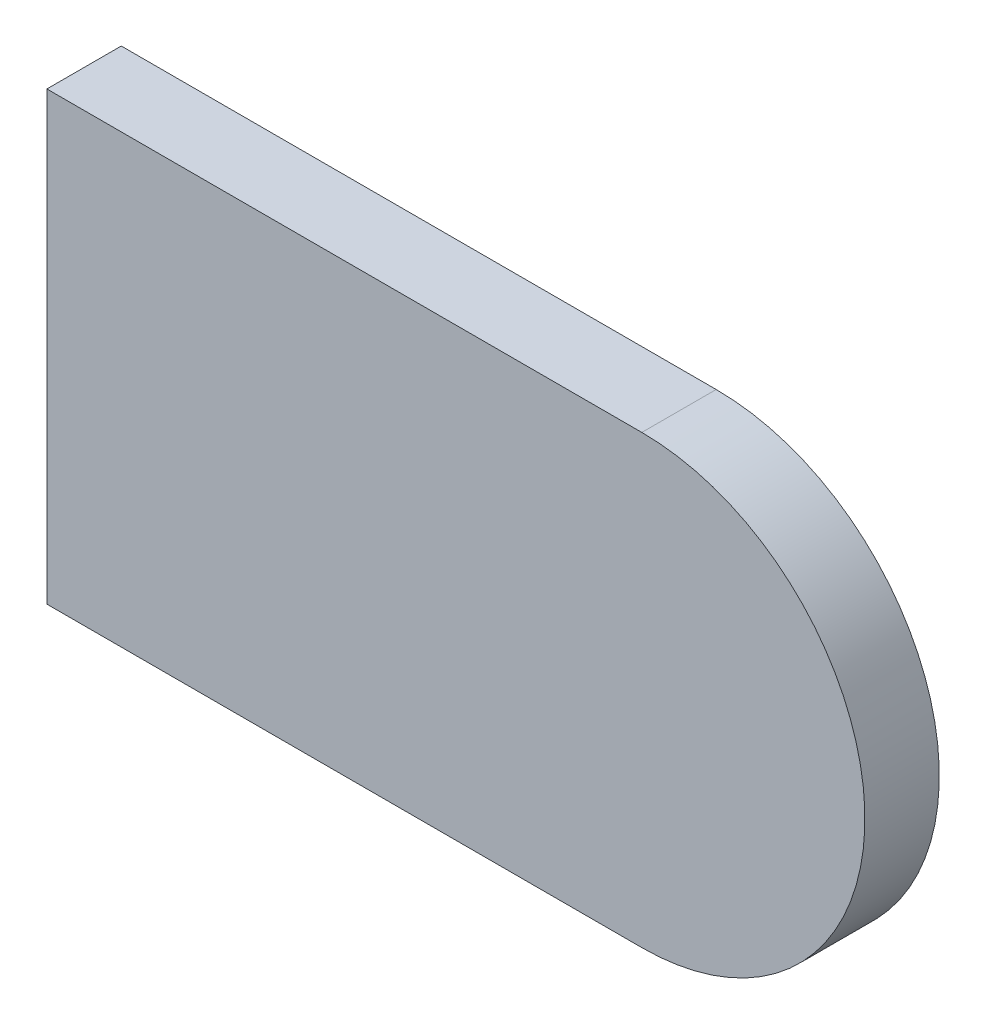
ISO-10303-21;
HEADER;
FILE_DESCRIPTION(('STEP AP214'),'2;1');
FILE_NAME('part.step','',(''),(''),'','','');
FILE_SCHEMA(('AUTOMOTIVE_DESIGN { 1 0 10303 214 1 1 1 1 }'));
ENDSEC;
DATA;
#1=APPLICATION_CONTEXT('core data for automotive mechanical design processes');
#2=APPLICATION_PROTOCOL_DEFINITION('international standard','automotive_design',2000,#1);
#3=PRODUCT_CONTEXT('',#1,'mechanical');
#4=PRODUCT('Part','Part','',(#3));
#5=PRODUCT_RELATED_PRODUCT_CATEGORY('part','',(#4));
#6=PRODUCT_DEFINITION_FORMATION('','',#4);
#7=PRODUCT_DEFINITION_CONTEXT('part definition',#1,'design');
#8=PRODUCT_DEFINITION('design','',#6,#7);
#9=PRODUCT_DEFINITION_SHAPE('','',#8);
#10=(LENGTH_UNIT() NAMED_UNIT(*) SI_UNIT(.MILLI.,.METRE.));
#11=(NAMED_UNIT(*) PLANE_ANGLE_UNIT() SI_UNIT($,.RADIAN.));
#12=(NAMED_UNIT(*) SI_UNIT($,.STERADIAN.) SOLID_ANGLE_UNIT());
#13=UNCERTAINTY_MEASURE_WITH_UNIT(LENGTH_MEASURE(1.E-05),#10,'distance_accuracy_value','');
#14=(GEOMETRIC_REPRESENTATION_CONTEXT(3) GLOBAL_UNCERTAINTY_ASSIGNED_CONTEXT((#13)) GLOBAL_UNIT_ASSIGNED_CONTEXT((#10,
#11,#12)) REPRESENTATION_CONTEXT('',''));
#15=CARTESIAN_POINT('',(0.,0.,0.));
#16=DIRECTION('',(0.,0.,1.));
#17=DIRECTION('',(1.,0.,0.));
#18=AXIS2_PLACEMENT_3D('',#15,#16,#17);
#19=CARTESIAN_POINT('',(0.,0.,10.));
#20=DIRECTION('',(1.,0.,0.));
#21=DIRECTION('',(0.,1.,0.));
#22=AXIS2_PLACEMENT_3D('',#19,#20,#21);
#23=PLANE('',#22);
#24=DIRECTION('',(0.,-1.,0.));
#25=VECTOR('',#24,1.);
#26=CARTESIAN_POINT('',(0.,0.,0.));
#27=LINE('',#26,#25);
#28=CARTESIAN_POINT('',(0.,0.,0.));
#29=VERTEX_POINT('',#28);
#30=CARTESIAN_POINT('',(0.,-60.,0.));
#31=VERTEX_POINT('',#30);
#32=EDGE_CURVE('E100',#29,#31,#27,.T.);
#33=ORIENTED_EDGE('',*,*,#32,.T.);
#34=DIRECTION('',(0.,0.,-1.));
#35=VECTOR('',#34,1.);
#36=CARTESIAN_POINT('',(0.,-60.,10.));
#37=LINE('',#36,#35);
#38=CARTESIAN_POINT('',(0.,-60.,10.));
#39=VERTEX_POINT('',#38);
#40=EDGE_CURVE('E11',#39,#31,#37,.T.);
#41=ORIENTED_EDGE('',*,*,#40,.F.);
#42=DIRECTION('',(0.,-1.,0.));
#43=VECTOR('',#42,1.);
#44=CARTESIAN_POINT('',(0.,0.,10.));
#45=LINE('',#44,#43);
#46=CARTESIAN_POINT('',(0.,0.,10.));
#47=VERTEX_POINT('',#46);
#48=EDGE_CURVE('E88',#47,#39,#45,.T.);
#49=ORIENTED_EDGE('',*,*,#48,.F.);
#50=DIRECTION('',(0.,0.,-1.));
#51=VECTOR('',#50,1.);
#52=CARTESIAN_POINT('',(0.,0.,10.));
#53=LINE('',#52,#51);
#54=EDGE_CURVE('E96',#47,#29,#53,.T.);
#55=ORIENTED_EDGE('',*,*,#54,.T.);
#56=EDGE_LOOP('',(#33,#41,#49,#55));
#57=FACE_BOUND('',#56,.T.);
#58=ADVANCED_FACE('F37',(#57),#23,.F.);
#59=CARTESIAN_POINT('',(0.,-60.,10.));
#60=DIRECTION('',(0.,1.,0.));
#61=DIRECTION('',(0.,0.,1.));
#62=AXIS2_PLACEMENT_3D('',#59,#60,#61);
#63=PLANE('',#62);
#64=DIRECTION('',(1.,0.,0.));
#65=VECTOR('',#64,1.);
#66=CARTESIAN_POINT('',(0.,-60.,0.));
#67=LINE('',#66,#65);
#68=CARTESIAN_POINT('',(80.,-60.,0.));
#69=VERTEX_POINT('',#68);
#70=EDGE_CURVE('E92',#31,#69,#67,.T.);
#71=ORIENTED_EDGE('',*,*,#70,.T.);
#72=DIRECTION('',(0.,0.,-1.));
#73=VECTOR('',#72,1.);
#74=CARTESIAN_POINT('',(80.,-60.,10.));
#75=LINE('',#74,#73);
#76=CARTESIAN_POINT('',(80.,-60.,10.));
#77=VERTEX_POINT('',#76);
#78=EDGE_CURVE('E45',#77,#69,#75,.T.);
#79=ORIENTED_EDGE('',*,*,#78,.F.);
#80=DIRECTION('',(1.,0.,0.));
#81=VECTOR('',#80,1.);
#82=CARTESIAN_POINT('',(0.,-60.,10.));
#83=LINE('',#82,#81);
#84=EDGE_CURVE('E83',#39,#77,#83,.T.);
#85=ORIENTED_EDGE('',*,*,#84,.F.);
#86=ORIENTED_EDGE('',*,*,#40,.T.);
#87=EDGE_LOOP('',(#71,#79,#85,#86));
#88=FACE_BOUND('',#87,.T.);
#89=ADVANCED_FACE('F91',(#88),#63,.F.);
#90=CARTESIAN_POINT('',(80.,-30.,10.));
#91=DIRECTION('',(0.,0.,-1.));
#92=DIRECTION('',(-1.,0.,0.));
#93=AXIS2_PLACEMENT_3D('',#90,#91,#92);
#94=CYLINDRICAL_SURFACE('',#93,30.);
#95=CARTESIAN_POINT('',(80.,-30.,0.));
#96=DIRECTION('',(0.,0.,1.));
#97=DIRECTION('',(-1.,0.,0.));
#98=AXIS2_PLACEMENT_3D('',#95,#96,#97);
#99=CIRCLE('',#98,30.);
#100=CARTESIAN_POINT('',(80.,0.,0.));
#101=VERTEX_POINT('',#100);
#102=EDGE_CURVE('E70',#69,#101,#99,.T.);
#103=ORIENTED_EDGE('',*,*,#102,.T.);
#104=DIRECTION('',(0.,0.,-1.));
#105=VECTOR('',#104,1.);
#106=CARTESIAN_POINT('',(80.,0.,10.));
#107=LINE('',#106,#105);
#108=CARTESIAN_POINT('',(80.,0.,10.));
#109=VERTEX_POINT('',#108);
#110=EDGE_CURVE('E93',#109,#101,#107,.T.);
#111=ORIENTED_EDGE('',*,*,#110,.F.);
#112=CARTESIAN_POINT('',(80.,-30.,10.));
#113=DIRECTION('',(0.,0.,1.));
#114=DIRECTION('',(-1.,0.,0.));
#115=AXIS2_PLACEMENT_3D('',#112,#113,#114);
#116=CIRCLE('',#115,30.);
#117=EDGE_CURVE('E86',#77,#109,#116,.T.);
#118=ORIENTED_EDGE('',*,*,#117,.F.);
#119=ORIENTED_EDGE('',*,*,#78,.T.);
#120=EDGE_LOOP('',(#103,#111,#118,#119));
#121=FACE_BOUND('',#120,.T.);
#122=ADVANCED_FACE('F94',(#121),#94,.T.);
#123=CARTESIAN_POINT('',(0.,0.,10.));
#124=DIRECTION('',(0.,-1.,0.));
#125=DIRECTION('',(0.,0.,-1.));
#126=AXIS2_PLACEMENT_3D('',#123,#124,#125);
#127=PLANE('',#126);
#128=DIRECTION('',(-1.,0.,0.));
#129=VECTOR('',#128,1.);
#130=CARTESIAN_POINT('',(0.,0.,0.));
#131=LINE('',#130,#129);
#132=EDGE_CURVE('E76',#101,#29,#131,.T.);
#133=ORIENTED_EDGE('',*,*,#132,.T.);
#134=ORIENTED_EDGE('',*,*,#54,.F.);
#135=DIRECTION('',(-1.,0.,0.));
#136=VECTOR('',#135,1.);
#137=CARTESIAN_POINT('',(0.,0.,10.));
#138=LINE('',#137,#136);
#139=EDGE_CURVE('E53',#109,#47,#138,.T.);
#140=ORIENTED_EDGE('',*,*,#139,.F.);
#141=ORIENTED_EDGE('',*,*,#110,.T.);
#142=EDGE_LOOP('',(#133,#134,#140,#141));
#143=FACE_BOUND('',#142,.T.);
#144=ADVANCED_FACE('F107',(#143),#127,.F.);
#145=CARTESIAN_POINT('',(80.,-30.,10.));
#146=DIRECTION('',(0.,0.,-1.));
#147=DIRECTION('',(-1.,0.,0.));
#148=AXIS2_PLACEMENT_3D('',#145,#146,#147);
#149=PLANE('',#148);
#150=ORIENTED_EDGE('',*,*,#48,.T.);
#151=ORIENTED_EDGE('',*,*,#84,.T.);
#152=ORIENTED_EDGE('',*,*,#117,.T.);
#153=ORIENTED_EDGE('',*,*,#139,.T.);
#154=EDGE_LOOP('',(#150,#151,#152,#153));
#155=FACE_BOUND('',#154,.T.);
#156=ADVANCED_FACE('F84',(#155),#149,.F.);
#157=CARTESIAN_POINT('',(80.,-30.,0.));
#158=DIRECTION('',(0.,0.,-1.));
#159=DIRECTION('',(-1.,0.,0.));
#160=AXIS2_PLACEMENT_3D('',#157,#158,#159);
#161=PLANE('',#160);
#162=ORIENTED_EDGE('',*,*,#32,.F.);
#163=ORIENTED_EDGE('',*,*,#132,.F.);
#164=ORIENTED_EDGE('',*,*,#102,.F.);
#165=ORIENTED_EDGE('',*,*,#70,.F.);
#166=EDGE_LOOP('',(#162,#163,#164,#165));
#167=FACE_BOUND('',#166,.T.);
#168=ADVANCED_FACE('F110',(#167),#161,.T.);
#169=CLOSED_SHELL('',(#58,#89,#122,#144,#156,#168));
#170=MANIFOLD_SOLID_BREP('B2',#169);
#171=ADVANCED_BREP_SHAPE_REPRESENTATION('',(#18,#170),#14);
#172=SHAPE_DEFINITION_REPRESENTATION(#9,#171);
ENDSEC;
END-ISO-10303-21;
